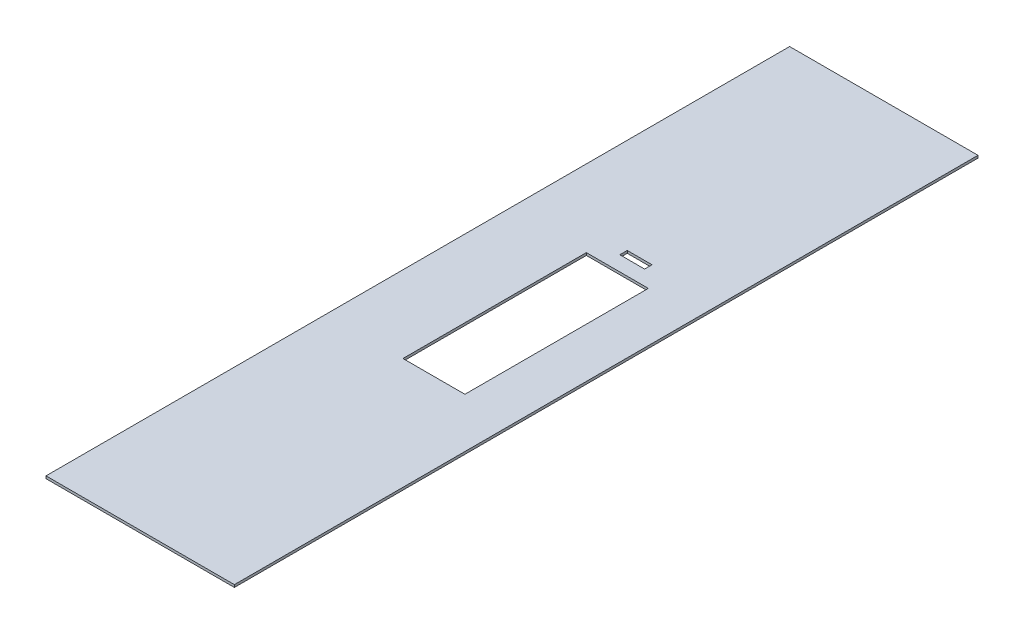
ISO-10303-21;
HEADER;
FILE_DESCRIPTION(('STEP AP214'),'2;1');
FILE_NAME('part.step','',(''),(''),'','','');
FILE_SCHEMA(('AUTOMOTIVE_DESIGN { 1 0 10303 214 1 1 1 1 }'));
ENDSEC;
DATA;
#1=APPLICATION_CONTEXT('core data for automotive mechanical design processes');
#2=APPLICATION_PROTOCOL_DEFINITION('international standard','automotive_design',2000,#1);
#3=PRODUCT_CONTEXT('',#1,'mechanical');
#4=PRODUCT('Part','Part','',(#3));
#5=PRODUCT_RELATED_PRODUCT_CATEGORY('part','',(#4));
#6=PRODUCT_DEFINITION_FORMATION('','',#4);
#7=PRODUCT_DEFINITION_CONTEXT('part definition',#1,'design');
#8=PRODUCT_DEFINITION('design','',#6,#7);
#9=PRODUCT_DEFINITION_SHAPE('','',#8);
#10=(LENGTH_UNIT() NAMED_UNIT(*) SI_UNIT(.MILLI.,.METRE.));
#11=(NAMED_UNIT(*) PLANE_ANGLE_UNIT() SI_UNIT($,.RADIAN.));
#12=(NAMED_UNIT(*) SI_UNIT($,.STERADIAN.) SOLID_ANGLE_UNIT());
#13=UNCERTAINTY_MEASURE_WITH_UNIT(LENGTH_MEASURE(1.E-05),#10,'distance_accuracy_value','');
#14=(GEOMETRIC_REPRESENTATION_CONTEXT(3) GLOBAL_UNCERTAINTY_ASSIGNED_CONTEXT((#13)) GLOBAL_UNIT_ASSIGNED_CONTEXT((#10,
#11,#12)) REPRESENTATION_CONTEXT('',''));
#15=CARTESIAN_POINT('',(0.,0.,0.));
#16=DIRECTION('',(0.,0.,1.));
#17=DIRECTION('',(1.,0.,0.));
#18=AXIS2_PLACEMENT_3D('',#15,#16,#17);
#19=CARTESIAN_POINT('',(0.,-1.,300.));
#20=DIRECTION('',(0.,1.,0.));
#21=DIRECTION('',(0.,0.,1.));
#22=AXIS2_PLACEMENT_3D('',#19,#20,#21);
#23=PLANE('',#22);
#24=DIRECTION('',(-1.,0.,0.));
#25=VECTOR('',#24,1.);
#26=CARTESIAN_POINT('',(48.5,-1.,107.));
#27=LINE('',#26,#25);
#28=CARTESIAN_POINT('',(48.5,-1.,107.));
#29=VERTEX_POINT('',#28);
#30=CARTESIAN_POINT('',(38.5,-1.,107.));
#31=VERTEX_POINT('',#30);
#32=EDGE_CURVE('E130',#29,#31,#27,.T.);
#33=ORIENTED_EDGE('',*,*,#32,.F.);
#34=DIRECTION('',(0.,0.,1.));
#35=VECTOR('',#34,1.);
#36=CARTESIAN_POINT('',(48.5,-1.,107.));
#37=LINE('',#36,#35);
#38=CARTESIAN_POINT('',(48.5,-1.,104.));
#39=VERTEX_POINT('',#38);
#40=EDGE_CURVE('E45',#39,#29,#37,.T.);
#41=ORIENTED_EDGE('',*,*,#40,.F.);
#42=DIRECTION('',(1.,0.,0.));
#43=VECTOR('',#42,1.);
#44=CARTESIAN_POINT('',(48.5,-1.,104.));
#45=LINE('',#44,#43);
#46=CARTESIAN_POINT('',(38.5,-1.,104.));
#47=VERTEX_POINT('',#46);
#48=EDGE_CURVE('E136',#47,#39,#45,.T.);
#49=ORIENTED_EDGE('',*,*,#48,.F.);
#50=DIRECTION('',(0.,0.,-1.));
#51=VECTOR('',#50,1.);
#52=CARTESIAN_POINT('',(38.5,-1.,107.));
#53=LINE('',#52,#51);
#54=EDGE_CURVE('E121',#31,#47,#53,.T.);
#55=ORIENTED_EDGE('',*,*,#54,.F.);
#56=EDGE_LOOP('',(#33,#41,#49,#55));
#57=FACE_BOUND('',#56,.T.);
#58=DIRECTION('',(-1.,0.,0.));
#59=VECTOR('',#58,1.);
#60=CARTESIAN_POINT('',(56.,-1.,187.));
#61=LINE('',#60,#59);
#62=CARTESIAN_POINT('',(56.,-1.,187.));
#63=VERTEX_POINT('',#62);
#64=CARTESIAN_POINT('',(31.,-1.,187.));
#65=VERTEX_POINT('',#64);
#66=EDGE_CURVE('E147',#63,#65,#61,.T.);
#67=ORIENTED_EDGE('',*,*,#66,.F.);
#68=DIRECTION('',(0.,0.,1.));
#69=VECTOR('',#68,1.);
#70=CARTESIAN_POINT('',(56.,-1.,187.));
#71=LINE('',#70,#69);
#72=CARTESIAN_POINT('',(56.,-1.,113.));
#73=VERTEX_POINT('',#72);
#74=EDGE_CURVE('E143',#73,#63,#71,.T.);
#75=ORIENTED_EDGE('',*,*,#74,.F.);
#76=DIRECTION('',(1.,0.,0.));
#77=VECTOR('',#76,1.);
#78=CARTESIAN_POINT('',(56.,-1.,113.));
#79=LINE('',#78,#77);
#80=CARTESIAN_POINT('',(31.,-1.,113.));
#81=VERTEX_POINT('',#80);
#82=EDGE_CURVE('E153',#81,#73,#79,.T.);
#83=ORIENTED_EDGE('',*,*,#82,.F.);
#84=DIRECTION('',(0.,0.,-1.));
#85=VECTOR('',#84,1.);
#86=CARTESIAN_POINT('',(31.,-1.,187.));
#87=LINE('',#86,#85);
#88=EDGE_CURVE('E150',#65,#81,#87,.T.);
#89=ORIENTED_EDGE('',*,*,#88,.F.);
#90=EDGE_LOOP('',(#67,#75,#83,#89));
#91=FACE_BOUND('',#90,.T.);
#92=DIRECTION('',(1.,0.,0.));
#93=VECTOR('',#92,1.);
#94=CARTESIAN_POINT('',(0.,-1.,0.));
#95=LINE('',#94,#93);
#96=CARTESIAN_POINT('',(0.,-1.,0.));
#97=VERTEX_POINT('',#96);
#98=CARTESIAN_POINT('',(76.,-1.,0.));
#99=VERTEX_POINT('',#98);
#100=EDGE_CURVE('E159',#97,#99,#95,.T.);
#101=ORIENTED_EDGE('',*,*,#100,.T.);
#102=DIRECTION('',(0.,0.,-1.));
#103=VECTOR('',#102,1.);
#104=CARTESIAN_POINT('',(76.,-1.,300.));
#105=LINE('',#104,#103);
#106=CARTESIAN_POINT('',(76.,-1.,300.));
#107=VERTEX_POINT('',#106);
#108=EDGE_CURVE('E194',#107,#99,#105,.T.);
#109=ORIENTED_EDGE('',*,*,#108,.F.);
#110=DIRECTION('',(1.,0.,0.));
#111=VECTOR('',#110,1.);
#112=CARTESIAN_POINT('',(0.,-1.,300.));
#113=LINE('',#112,#111);
#114=CARTESIAN_POINT('',(0.,-1.,300.));
#115=VERTEX_POINT('',#114);
#116=EDGE_CURVE('E166',#115,#107,#113,.T.);
#117=ORIENTED_EDGE('',*,*,#116,.F.);
#118=DIRECTION('',(0.,0.,-1.));
#119=VECTOR('',#118,1.);
#120=CARTESIAN_POINT('',(0.,-1.,300.));
#121=LINE('',#120,#119);
#122=EDGE_CURVE('E178',#115,#97,#121,.T.);
#123=ORIENTED_EDGE('',*,*,#122,.T.);
#124=EDGE_LOOP('',(#101,#109,#117,#123));
#125=FACE_BOUND('',#124,.T.);
#126=ADVANCED_FACE('F31',(#57,#91,#125),#23,.F.);
#127=CARTESIAN_POINT('',(76.,0.,300.));
#128=DIRECTION('',(1.,0.,0.));
#129=DIRECTION('',(0.,0.,-1.));
#130=AXIS2_PLACEMENT_3D('',#127,#128,#129);
#131=PLANE('',#130);
#132=DIRECTION('',(0.,-1.,0.));
#133=VECTOR('',#132,1.);
#134=CARTESIAN_POINT('',(76.,0.,0.));
#135=LINE('',#134,#133);
#136=CARTESIAN_POINT('',(76.,0.,0.));
#137=VERTEX_POINT('',#136);
#138=EDGE_CURVE('E181',#137,#99,#135,.T.);
#139=ORIENTED_EDGE('',*,*,#138,.F.);
#140=DIRECTION('',(0.,0.,-1.));
#141=VECTOR('',#140,1.);
#142=CARTESIAN_POINT('',(76.,0.,300.));
#143=LINE('',#142,#141);
#144=CARTESIAN_POINT('',(76.,0.,300.));
#145=VERTEX_POINT('',#144);
#146=EDGE_CURVE('E192',#145,#137,#143,.T.);
#147=ORIENTED_EDGE('',*,*,#146,.F.);
#148=DIRECTION('',(0.,-1.,0.));
#149=VECTOR('',#148,1.);
#150=CARTESIAN_POINT('',(76.,0.,300.));
#151=LINE('',#150,#149);
#152=EDGE_CURVE('E168',#145,#107,#151,.T.);
#153=ORIENTED_EDGE('',*,*,#152,.T.);
#154=ORIENTED_EDGE('',*,*,#108,.T.);
#155=EDGE_LOOP('',(#139,#147,#153,#154));
#156=FACE_BOUND('',#155,.T.);
#157=ADVANCED_FACE('F230',(#156),#131,.T.);
#158=CARTESIAN_POINT('',(0.,0.,300.));
#159=DIRECTION('',(0.,1.,0.));
#160=DIRECTION('',(0.,0.,1.));
#161=AXIS2_PLACEMENT_3D('',#158,#159,#160);
#162=PLANE('',#161);
#163=DIRECTION('',(0.,0.,-1.));
#164=VECTOR('',#163,1.);
#165=CARTESIAN_POINT('',(48.5000000000004,0.,300.));
#166=LINE('',#165,#164);
#167=CARTESIAN_POINT('',(48.5,0.,107.));
#168=VERTEX_POINT('',#167);
#169=CARTESIAN_POINT('',(48.5,0.,104.));
#170=VERTEX_POINT('',#169);
#171=EDGE_CURVE('E11',#168,#170,#166,.T.);
#172=ORIENTED_EDGE('',*,*,#171,.F.);
#173=DIRECTION('',(1.,0.,0.));
#174=VECTOR('',#173,1.);
#175=CARTESIAN_POINT('',(0.,0.,107.));
#176=LINE('',#175,#174);
#177=CARTESIAN_POINT('',(38.5,0.,107.));
#178=VERTEX_POINT('',#177);
#179=EDGE_CURVE('E205',#178,#168,#176,.T.);
#180=ORIENTED_EDGE('',*,*,#179,.F.);
#181=DIRECTION('',(0.,0.,1.));
#182=VECTOR('',#181,1.);
#183=CARTESIAN_POINT('',(38.5000000000004,0.,300.));
#184=LINE('',#183,#182);
#185=CARTESIAN_POINT('',(38.5,0.,104.));
#186=VERTEX_POINT('',#185);
#187=EDGE_CURVE('E124',#186,#178,#184,.T.);
#188=ORIENTED_EDGE('',*,*,#187,.F.);
#189=DIRECTION('',(-1.,0.,0.));
#190=VECTOR('',#189,1.);
#191=CARTESIAN_POINT('',(0.,0.,104.));
#192=LINE('',#191,#190);
#193=EDGE_CURVE('E38',#170,#186,#192,.T.);
#194=ORIENTED_EDGE('',*,*,#193,.F.);
#195=EDGE_LOOP('',(#172,#180,#188,#194));
#196=FACE_BOUND('',#195,.T.);
#197=DIRECTION('',(0.,0.,-1.));
#198=VECTOR('',#197,1.);
#199=CARTESIAN_POINT('',(56.,0.,300.));
#200=LINE('',#199,#198);
#201=CARTESIAN_POINT('',(56.,0.,187.));
#202=VERTEX_POINT('',#201);
#203=CARTESIAN_POINT('',(56.,0.,113.));
#204=VERTEX_POINT('',#203);
#205=EDGE_CURVE('E203',#202,#204,#200,.T.);
#206=ORIENTED_EDGE('',*,*,#205,.F.);
#207=DIRECTION('',(1.,0.,0.));
#208=VECTOR('',#207,1.);
#209=CARTESIAN_POINT('',(0.,0.,187.));
#210=LINE('',#209,#208);
#211=CARTESIAN_POINT('',(31.,0.,187.));
#212=VERTEX_POINT('',#211);
#213=EDGE_CURVE('E196',#212,#202,#210,.T.);
#214=ORIENTED_EDGE('',*,*,#213,.F.);
#215=DIRECTION('',(0.,0.,1.));
#216=VECTOR('',#215,1.);
#217=CARTESIAN_POINT('',(31.,0.,300.));
#218=LINE('',#217,#216);
#219=CARTESIAN_POINT('',(31.,0.,113.));
#220=VERTEX_POINT('',#219);
#221=EDGE_CURVE('E198',#220,#212,#218,.T.);
#222=ORIENTED_EDGE('',*,*,#221,.F.);
#223=DIRECTION('',(-1.,0.,0.));
#224=VECTOR('',#223,1.);
#225=CARTESIAN_POINT('',(0.,0.,113.));
#226=LINE('',#225,#224);
#227=EDGE_CURVE('E201',#204,#220,#226,.T.);
#228=ORIENTED_EDGE('',*,*,#227,.F.);
#229=EDGE_LOOP('',(#206,#214,#222,#228));
#230=FACE_BOUND('',#229,.T.);
#231=DIRECTION('',(1.,0.,0.));
#232=VECTOR('',#231,1.);
#233=CARTESIAN_POINT('',(0.,0.,0.));
#234=LINE('',#233,#232);
#235=CARTESIAN_POINT('',(0.,0.,0.));
#236=VERTEX_POINT('',#235);
#237=EDGE_CURVE('E184',#236,#137,#234,.T.);
#238=ORIENTED_EDGE('',*,*,#237,.F.);
#239=DIRECTION('',(0.,0.,-1.));
#240=VECTOR('',#239,1.);
#241=CARTESIAN_POINT('',(0.,0.,300.));
#242=LINE('',#241,#240);
#243=CARTESIAN_POINT('',(0.,0.,300.));
#244=VERTEX_POINT('',#243);
#245=EDGE_CURVE('E190',#244,#236,#242,.T.);
#246=ORIENTED_EDGE('',*,*,#245,.F.);
#247=DIRECTION('',(1.,0.,0.));
#248=VECTOR('',#247,1.);
#249=CARTESIAN_POINT('',(0.,0.,300.));
#250=LINE('',#249,#248);
#251=EDGE_CURVE('E172',#244,#145,#250,.T.);
#252=ORIENTED_EDGE('',*,*,#251,.T.);
#253=ORIENTED_EDGE('',*,*,#146,.T.);
#254=EDGE_LOOP('',(#238,#246,#252,#253));
#255=FACE_BOUND('',#254,.T.);
#256=ADVANCED_FACE('F213',(#196,#230,#255),#162,.T.);
#257=CARTESIAN_POINT('',(0.,-1.,300.));
#258=DIRECTION('',(-1.,0.,0.));
#259=DIRECTION('',(0.,0.,1.));
#260=AXIS2_PLACEMENT_3D('',#257,#258,#259);
#261=PLANE('',#260);
#262=DIRECTION('',(0.,1.,0.));
#263=VECTOR('',#262,1.);
#264=CARTESIAN_POINT('',(0.,-1.,0.));
#265=LINE('',#264,#263);
#266=EDGE_CURVE('E169',#97,#236,#265,.T.);
#267=ORIENTED_EDGE('',*,*,#266,.F.);
#268=ORIENTED_EDGE('',*,*,#122,.F.);
#269=DIRECTION('',(0.,1.,0.));
#270=VECTOR('',#269,1.);
#271=CARTESIAN_POINT('',(0.,-1.,300.));
#272=LINE('',#271,#270);
#273=EDGE_CURVE('E175',#115,#244,#272,.T.);
#274=ORIENTED_EDGE('',*,*,#273,.T.);
#275=ORIENTED_EDGE('',*,*,#245,.T.);
#276=EDGE_LOOP('',(#267,#268,#274,#275));
#277=FACE_BOUND('',#276,.T.);
#278=ADVANCED_FACE('F240',(#277),#261,.T.);
#279=CARTESIAN_POINT('',(76.,-1.,300.));
#280=DIRECTION('',(0.,0.,-1.));
#281=DIRECTION('',(-1.,0.,0.));
#282=AXIS2_PLACEMENT_3D('',#279,#280,#281);
#283=PLANE('',#282);
#284=ORIENTED_EDGE('',*,*,#116,.T.);
#285=ORIENTED_EDGE('',*,*,#152,.F.);
#286=ORIENTED_EDGE('',*,*,#251,.F.);
#287=ORIENTED_EDGE('',*,*,#273,.F.);
#288=EDGE_LOOP('',(#284,#285,#286,#287));
#289=FACE_BOUND('',#288,.T.);
#290=ADVANCED_FACE('F246',(#289),#283,.F.);
#291=CARTESIAN_POINT('',(76.,-1.,0.));
#292=DIRECTION('',(0.,0.,-1.));
#293=DIRECTION('',(-1.,0.,0.));
#294=AXIS2_PLACEMENT_3D('',#291,#292,#293);
#295=PLANE('',#294);
#296=ORIENTED_EDGE('',*,*,#100,.F.);
#297=ORIENTED_EDGE('',*,*,#266,.T.);
#298=ORIENTED_EDGE('',*,*,#237,.T.);
#299=ORIENTED_EDGE('',*,*,#138,.T.);
#300=EDGE_LOOP('',(#296,#297,#298,#299));
#301=FACE_BOUND('',#300,.T.);
#302=ADVANCED_FACE('F248',(#301),#295,.T.);
#303=CARTESIAN_POINT('',(56.,9.,187.));
#304=DIRECTION('',(1.,0.,0.));
#305=DIRECTION('',(0.,0.,-1.));
#306=AXIS2_PLACEMENT_3D('',#303,#304,#305);
#307=PLANE('',#306);
#308=ORIENTED_EDGE('',*,*,#205,.T.);
#309=DIRECTION('',(0.,-1.,0.));
#310=VECTOR('',#309,1.);
#311=CARTESIAN_POINT('',(56.,9.,113.));
#312=LINE('',#311,#310);
#313=EDGE_CURVE('E157',#204,#73,#312,.T.);
#314=ORIENTED_EDGE('',*,*,#313,.T.);
#315=ORIENTED_EDGE('',*,*,#74,.T.);
#316=DIRECTION('',(0.,-1.,0.));
#317=VECTOR('',#316,1.);
#318=CARTESIAN_POINT('',(56.,9.,187.));
#319=LINE('',#318,#317);
#320=EDGE_CURVE('E156',#202,#63,#319,.T.);
#321=ORIENTED_EDGE('',*,*,#320,.F.);
#322=EDGE_LOOP('',(#308,#314,#315,#321));
#323=FACE_BOUND('',#322,.T.);
#324=ADVANCED_FACE('F251',(#323),#307,.F.);
#325=CARTESIAN_POINT('',(56.,9.,113.));
#326=DIRECTION('',(0.,0.,-1.));
#327=DIRECTION('',(-1.,0.,0.));
#328=AXIS2_PLACEMENT_3D('',#325,#326,#327);
#329=PLANE('',#328);
#330=ORIENTED_EDGE('',*,*,#227,.T.);
#331=DIRECTION('',(0.,-1.,0.));
#332=VECTOR('',#331,1.);
#333=CARTESIAN_POINT('',(31.,9.,113.));
#334=LINE('',#333,#332);
#335=EDGE_CURVE('E160',#220,#81,#334,.T.);
#336=ORIENTED_EDGE('',*,*,#335,.T.);
#337=ORIENTED_EDGE('',*,*,#82,.T.);
#338=ORIENTED_EDGE('',*,*,#313,.F.);
#339=EDGE_LOOP('',(#330,#336,#337,#338));
#340=FACE_BOUND('',#339,.T.);
#341=ADVANCED_FACE('F257',(#340),#329,.F.);
#342=CARTESIAN_POINT('',(31.,9.,187.));
#343=DIRECTION('',(-1.,0.,0.));
#344=DIRECTION('',(0.,0.,1.));
#345=AXIS2_PLACEMENT_3D('',#342,#343,#344);
#346=PLANE('',#345);
#347=ORIENTED_EDGE('',*,*,#221,.T.);
#348=DIRECTION('',(0.,-1.,0.));
#349=VECTOR('',#348,1.);
#350=CARTESIAN_POINT('',(31.,9.,187.));
#351=LINE('',#350,#349);
#352=EDGE_CURVE('E162',#212,#65,#351,.T.);
#353=ORIENTED_EDGE('',*,*,#352,.T.);
#354=ORIENTED_EDGE('',*,*,#88,.T.);
#355=ORIENTED_EDGE('',*,*,#335,.F.);
#356=EDGE_LOOP('',(#347,#353,#354,#355));
#357=FACE_BOUND('',#356,.T.);
#358=ADVANCED_FACE('F224',(#357),#346,.F.);
#359=CARTESIAN_POINT('',(56.,9.,187.));
#360=DIRECTION('',(0.,0.,1.));
#361=DIRECTION('',(1.,0.,0.));
#362=AXIS2_PLACEMENT_3D('',#359,#360,#361);
#363=PLANE('',#362);
#364=ORIENTED_EDGE('',*,*,#213,.T.);
#365=ORIENTED_EDGE('',*,*,#320,.T.);
#366=ORIENTED_EDGE('',*,*,#66,.T.);
#367=ORIENTED_EDGE('',*,*,#352,.F.);
#368=EDGE_LOOP('',(#364,#365,#366,#367));
#369=FACE_BOUND('',#368,.T.);
#370=ADVANCED_FACE('F217',(#369),#363,.F.);
#371=CARTESIAN_POINT('',(48.5,9.,107.));
#372=DIRECTION('',(1.,0.,0.));
#373=DIRECTION('',(0.,0.,-1.));
#374=AXIS2_PLACEMENT_3D('',#371,#372,#373);
#375=PLANE('',#374);
#376=ORIENTED_EDGE('',*,*,#171,.T.);
#377=DIRECTION('',(0.,-1.,0.));
#378=VECTOR('',#377,1.);
#379=CARTESIAN_POINT('',(48.5,9.,104.));
#380=LINE('',#379,#378);
#381=EDGE_CURVE('E141',#170,#39,#380,.T.);
#382=ORIENTED_EDGE('',*,*,#381,.T.);
#383=ORIENTED_EDGE('',*,*,#40,.T.);
#384=DIRECTION('',(0.,-1.,0.));
#385=VECTOR('',#384,1.);
#386=CARTESIAN_POINT('',(48.5,9.,107.));
#387=LINE('',#386,#385);
#388=EDGE_CURVE('E127',#168,#29,#387,.T.);
#389=ORIENTED_EDGE('',*,*,#388,.F.);
#390=EDGE_LOOP('',(#376,#382,#383,#389));
#391=FACE_BOUND('',#390,.T.);
#392=ADVANCED_FACE('F215',(#391),#375,.F.);
#393=CARTESIAN_POINT('',(48.5,9.,104.));
#394=DIRECTION('',(0.,0.,-1.));
#395=DIRECTION('',(-1.,0.,0.));
#396=AXIS2_PLACEMENT_3D('',#393,#394,#395);
#397=PLANE('',#396);
#398=ORIENTED_EDGE('',*,*,#193,.T.);
#399=DIRECTION('',(0.,-1.,0.));
#400=VECTOR('',#399,1.);
#401=CARTESIAN_POINT('',(38.5,9.,104.));
#402=LINE('',#401,#400);
#403=EDGE_CURVE('E126',#186,#47,#402,.T.);
#404=ORIENTED_EDGE('',*,*,#403,.T.);
#405=ORIENTED_EDGE('',*,*,#48,.T.);
#406=ORIENTED_EDGE('',*,*,#381,.F.);
#407=EDGE_LOOP('',(#398,#404,#405,#406));
#408=FACE_BOUND('',#407,.T.);
#409=ADVANCED_FACE('F210',(#408),#397,.F.);
#410=CARTESIAN_POINT('',(38.5,9.,107.));
#411=DIRECTION('',(-1.,0.,0.));
#412=DIRECTION('',(0.,0.,1.));
#413=AXIS2_PLACEMENT_3D('',#410,#411,#412);
#414=PLANE('',#413);
#415=ORIENTED_EDGE('',*,*,#187,.T.);
#416=DIRECTION('',(0.,-1.,0.));
#417=VECTOR('',#416,1.);
#418=CARTESIAN_POINT('',(38.5,9.,107.));
#419=LINE('',#418,#417);
#420=EDGE_CURVE('E53',#178,#31,#419,.T.);
#421=ORIENTED_EDGE('',*,*,#420,.T.);
#422=ORIENTED_EDGE('',*,*,#54,.T.);
#423=ORIENTED_EDGE('',*,*,#403,.F.);
#424=EDGE_LOOP('',(#415,#421,#422,#423));
#425=FACE_BOUND('',#424,.T.);
#426=ADVANCED_FACE('F118',(#425),#414,.F.);
#427=CARTESIAN_POINT('',(48.5,9.,107.));
#428=DIRECTION('',(0.,0.,1.));
#429=DIRECTION('',(1.,0.,0.));
#430=AXIS2_PLACEMENT_3D('',#427,#428,#429);
#431=PLANE('',#430);
#432=ORIENTED_EDGE('',*,*,#179,.T.);
#433=ORIENTED_EDGE('',*,*,#388,.T.);
#434=ORIENTED_EDGE('',*,*,#32,.T.);
#435=ORIENTED_EDGE('',*,*,#420,.F.);
#436=EDGE_LOOP('',(#432,#433,#434,#435));
#437=FACE_BOUND('',#436,.T.);
#438=ADVANCED_FACE('F131',(#437),#431,.F.);
#439=CLOSED_SHELL('',(#126,#157,#256,#278,#290,#302,#324,#341,#358,#370,#392,#409,#426,#438));
#440=MANIFOLD_SOLID_BREP('B2',#439);
#441=ADVANCED_BREP_SHAPE_REPRESENTATION('',(#18,#440),#14);
#442=SHAPE_DEFINITION_REPRESENTATION(#9,#441);
ENDSEC;
END-ISO-10303-21;
